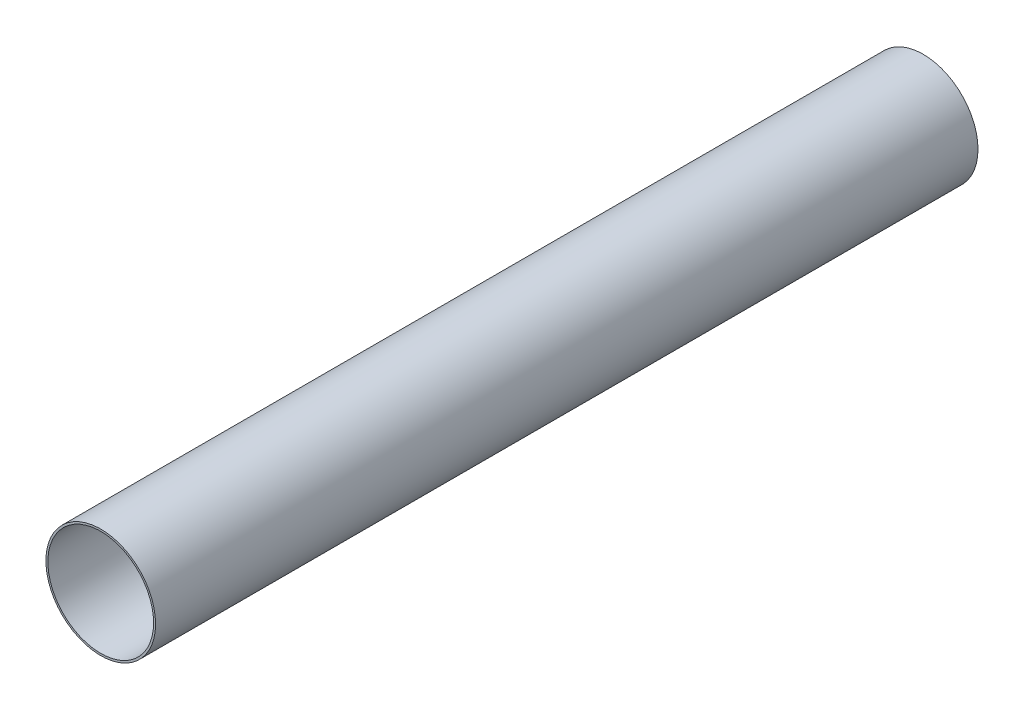
ISO-10303-21;
HEADER;
FILE_DESCRIPTION(('STEP AP214'),'2;1');
FILE_NAME('part.step','',(''),(''),'','','');
FILE_SCHEMA(('AUTOMOTIVE_DESIGN { 1 0 10303 214 1 1 1 1 }'));
ENDSEC;
DATA;
#1=APPLICATION_CONTEXT('core data for automotive mechanical design processes');
#2=APPLICATION_PROTOCOL_DEFINITION('international standard','automotive_design',2000,#1);
#3=PRODUCT_CONTEXT('',#1,'mechanical');
#4=PRODUCT('Part','Part','',(#3));
#5=PRODUCT_RELATED_PRODUCT_CATEGORY('part','',(#4));
#6=PRODUCT_DEFINITION_FORMATION('','',#4);
#7=PRODUCT_DEFINITION_CONTEXT('part definition',#1,'design');
#8=PRODUCT_DEFINITION('design','',#6,#7);
#9=PRODUCT_DEFINITION_SHAPE('','',#8);
#10=(LENGTH_UNIT() NAMED_UNIT(*) SI_UNIT(.MILLI.,.METRE.));
#11=(NAMED_UNIT(*) PLANE_ANGLE_UNIT() SI_UNIT($,.RADIAN.));
#12=(NAMED_UNIT(*) SI_UNIT($,.STERADIAN.) SOLID_ANGLE_UNIT());
#13=UNCERTAINTY_MEASURE_WITH_UNIT(LENGTH_MEASURE(1.E-05),#10,'distance_accuracy_value','');
#14=(GEOMETRIC_REPRESENTATION_CONTEXT(3) GLOBAL_UNCERTAINTY_ASSIGNED_CONTEXT((#13)) GLOBAL_UNIT_ASSIGNED_CONTEXT((#10,
#11,#12)) REPRESENTATION_CONTEXT('',''));
#15=CARTESIAN_POINT('',(0.,0.,0.));
#16=DIRECTION('',(0.,0.,1.));
#17=DIRECTION('',(1.,0.,0.));
#18=AXIS2_PLACEMENT_3D('',#15,#16,#17);
#19=CARTESIAN_POINT('',(0.,0.,2666.6));
#20=DIRECTION('',(0.,0.,1.));
#21=DIRECTION('',(1.,0.,0.));
#22=AXIS2_PLACEMENT_3D('',#19,#20,#21);
#23=PLANE('',#22);
#24=CARTESIAN_POINT('',(0.,0.,2666.6));
#25=DIRECTION('',(0.,0.,1.));
#26=DIRECTION('',(1.,0.,0.));
#27=AXIS2_PLACEMENT_3D('',#24,#25,#26);
#28=CIRCLE('',#27,177.8);
#29=CARTESIAN_POINT('',(177.8,0.,2666.6));
#30=VERTEX_POINT('',#29);
#31=EDGE_CURVE('E10',#30,#30,#28,.T.);
#32=ORIENTED_EDGE('',*,*,#31,.T.);
#33=EDGE_LOOP('',(#32));
#34=FACE_BOUND('',#33,.T.);
#35=CARTESIAN_POINT('',(0.,0.,2666.6));
#36=DIRECTION('',(0.,0.,1.));
#37=DIRECTION('',(1.,0.,0.));
#38=AXIS2_PLACEMENT_3D('',#35,#36,#37);
#39=CIRCLE('',#38,171.45);
#40=CARTESIAN_POINT('',(171.45,0.,2666.6));
#41=VERTEX_POINT('',#40);
#42=EDGE_CURVE('E40',#41,#41,#39,.T.);
#43=ORIENTED_EDGE('',*,*,#42,.F.);
#44=EDGE_LOOP('',(#43));
#45=FACE_BOUND('',#44,.T.);
#46=ADVANCED_FACE('F29',(#34,#45),#23,.T.);
#47=CARTESIAN_POINT('',(0.,0.,0.));
#48=DIRECTION('',(0.,0.,1.));
#49=DIRECTION('',(1.,0.,0.));
#50=AXIS2_PLACEMENT_3D('',#47,#48,#49);
#51=PLANE('',#50);
#52=CARTESIAN_POINT('',(0.,0.,0.));
#53=DIRECTION('',(0.,0.,1.));
#54=DIRECTION('',(1.,0.,0.));
#55=AXIS2_PLACEMENT_3D('',#52,#53,#54);
#56=CIRCLE('',#55,177.8);
#57=CARTESIAN_POINT('',(177.8,0.,0.));
#58=VERTEX_POINT('',#57);
#59=EDGE_CURVE('E33',#58,#58,#56,.T.);
#60=ORIENTED_EDGE('',*,*,#59,.F.);
#61=EDGE_LOOP('',(#60));
#62=FACE_BOUND('',#61,.T.);
#63=CARTESIAN_POINT('',(0.,0.,0.));
#64=DIRECTION('',(0.,0.,1.));
#65=DIRECTION('',(1.,0.,0.));
#66=AXIS2_PLACEMENT_3D('',#63,#64,#65);
#67=CIRCLE('',#66,171.45);
#68=CARTESIAN_POINT('',(171.45,0.,0.));
#69=VERTEX_POINT('',#68);
#70=EDGE_CURVE('E42',#69,#69,#67,.T.);
#71=ORIENTED_EDGE('',*,*,#70,.T.);
#72=EDGE_LOOP('',(#71));
#73=FACE_BOUND('',#72,.T.);
#74=ADVANCED_FACE('F52',(#62,#73),#51,.F.);
#75=CARTESIAN_POINT('',(0.,0.,2666.6));
#76=DIRECTION('',(0.,0.,-1.));
#77=DIRECTION('',(-1.,0.,0.));
#78=AXIS2_PLACEMENT_3D('',#75,#76,#77);
#79=CYLINDRICAL_SURFACE('',#78,177.8);
#80=ORIENTED_EDGE('',*,*,#31,.F.);
#81=EDGE_LOOP('',(#80));
#82=FACE_BOUND('',#81,.T.);
#83=ORIENTED_EDGE('',*,*,#59,.T.);
#84=EDGE_LOOP('',(#83));
#85=FACE_BOUND('',#84,.T.);
#86=ADVANCED_FACE('F31',(#82,#85),#79,.T.);
#87=CARTESIAN_POINT('',(0.,0.,2666.6));
#88=DIRECTION('',(0.,0.,-1.));
#89=DIRECTION('',(-1.,0.,0.));
#90=AXIS2_PLACEMENT_3D('',#87,#88,#89);
#91=CYLINDRICAL_SURFACE('',#90,171.45);
#92=ORIENTED_EDGE('',*,*,#42,.T.);
#93=EDGE_LOOP('',(#92));
#94=FACE_BOUND('',#93,.T.);
#95=ORIENTED_EDGE('',*,*,#70,.F.);
#96=EDGE_LOOP('',(#95));
#97=FACE_BOUND('',#96,.T.);
#98=ADVANCED_FACE('F48',(#94,#97),#91,.F.);
#99=CLOSED_SHELL('',(#46,#74,#86,#98));
#100=MANIFOLD_SOLID_BREP('B2',#99);
#101=ADVANCED_BREP_SHAPE_REPRESENTATION('',(#18,#100),#14);
#102=SHAPE_DEFINITION_REPRESENTATION(#9,#101);
ENDSEC;
END-ISO-10303-21;
